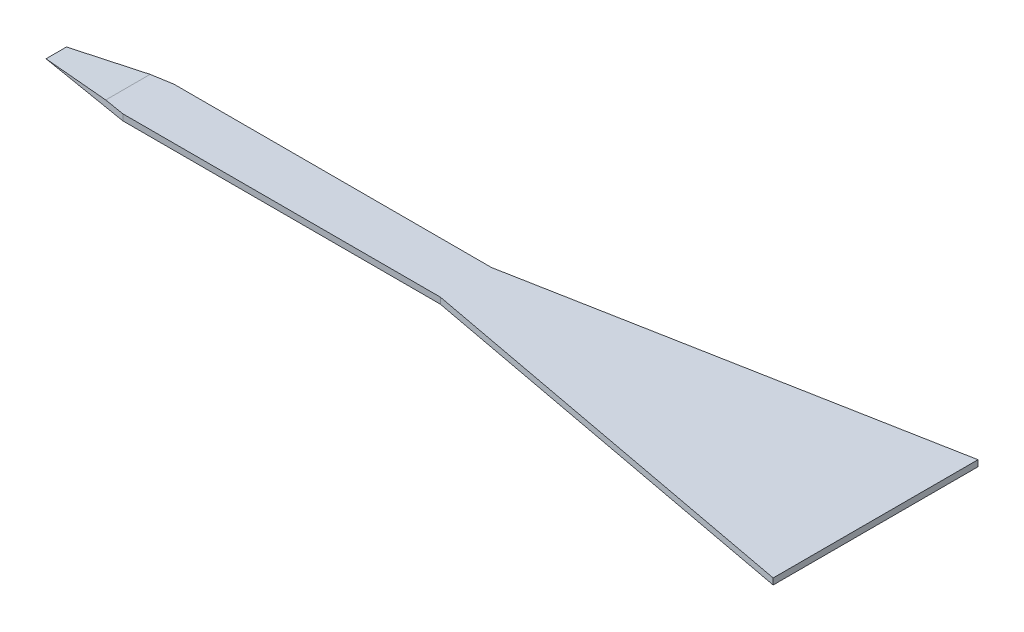
ISO-10303-21;
HEADER;
FILE_DESCRIPTION(('STEP AP214'),'2;1');
FILE_NAME('part.step','',(''),(''),'','','');
FILE_SCHEMA(('AUTOMOTIVE_DESIGN { 1 0 10303 214 1 1 1 1 }'));
ENDSEC;
DATA;
#1=APPLICATION_CONTEXT('core data for automotive mechanical design processes');
#2=APPLICATION_PROTOCOL_DEFINITION('international standard','automotive_design',2000,#1);
#3=PRODUCT_CONTEXT('',#1,'mechanical');
#4=PRODUCT('Part','Part','',(#3));
#5=PRODUCT_RELATED_PRODUCT_CATEGORY('part','',(#4));
#6=PRODUCT_DEFINITION_FORMATION('','',#4);
#7=PRODUCT_DEFINITION_CONTEXT('part definition',#1,'design');
#8=PRODUCT_DEFINITION('design','',#6,#7);
#9=PRODUCT_DEFINITION_SHAPE('','',#8);
#10=(LENGTH_UNIT() NAMED_UNIT(*) SI_UNIT(.MILLI.,.METRE.));
#11=(NAMED_UNIT(*) PLANE_ANGLE_UNIT() SI_UNIT($,.RADIAN.));
#12=(NAMED_UNIT(*) SI_UNIT($,.STERADIAN.) SOLID_ANGLE_UNIT());
#13=UNCERTAINTY_MEASURE_WITH_UNIT(LENGTH_MEASURE(1.E-05),#10,'distance_accuracy_value','');
#14=(GEOMETRIC_REPRESENTATION_CONTEXT(3) GLOBAL_UNCERTAINTY_ASSIGNED_CONTEXT((#13)) GLOBAL_UNIT_ASSIGNED_CONTEXT((#10,
#11,#12)) REPRESENTATION_CONTEXT('',''));
#15=CARTESIAN_POINT('',(0.,0.,0.));
#16=DIRECTION('',(0.,0.,1.));
#17=DIRECTION('',(1.,0.,0.));
#18=AXIS2_PLACEMENT_3D('',#15,#16,#17);
#19=CARTESIAN_POINT('',(0.,0.06,-0.25));
#20=DIRECTION('',(0.,0.,-1.));
#21=DIRECTION('',(-1.,0.,0.));
#22=AXIS2_PLACEMENT_3D('',#19,#20,#21);
#23=PLANE('',#22);
#24=DIRECTION('',(1.,0.,0.));
#25=VECTOR('',#24,1.);
#26=CARTESIAN_POINT('',(0.,0.,-0.25));
#27=LINE('',#26,#25);
#28=CARTESIAN_POINT('',(-7.1,0.,-0.249999999999999));
#29=VERTEX_POINT('',#28);
#30=CARTESIAN_POINT('',(-4.,0.,-0.25));
#31=VERTEX_POINT('',#30);
#32=EDGE_CURVE('E125',#29,#31,#27,.T.);
#33=ORIENTED_EDGE('',*,*,#32,.F.);
#34=DIRECTION('',(0.,-1.,0.));
#35=VECTOR('',#34,1.);
#36=CARTESIAN_POINT('',(-7.1,0.06,-0.249999999999999));
#37=LINE('',#36,#35);
#38=CARTESIAN_POINT('',(-7.1,0.06,-0.249999999999999));
#39=VERTEX_POINT('',#38);
#40=EDGE_CURVE('E112',#39,#29,#37,.T.);
#41=ORIENTED_EDGE('',*,*,#40,.F.);
#42=DIRECTION('',(1.,0.,0.));
#43=VECTOR('',#42,1.);
#44=CARTESIAN_POINT('',(0.,0.06,-0.25));
#45=LINE('',#44,#43);
#46=CARTESIAN_POINT('',(-4.,0.06,-0.25));
#47=VERTEX_POINT('',#46);
#48=EDGE_CURVE('E123',#39,#47,#45,.T.);
#49=ORIENTED_EDGE('',*,*,#48,.T.);
#50=DIRECTION('',(0.,-1.,0.));
#51=VECTOR('',#50,1.);
#52=CARTESIAN_POINT('',(-4.,0.06,-0.25));
#53=LINE('',#52,#51);
#54=EDGE_CURVE('E196',#47,#31,#53,.T.);
#55=ORIENTED_EDGE('',*,*,#54,.T.);
#56=EDGE_LOOP('',(#33,#41,#49,#55));
#57=FACE_BOUND('',#56,.T.);
#58=ADVANCED_FACE('F43',(#57),#23,.T.);
#59=CARTESIAN_POINT('',(0.,0.06,0.));
#60=DIRECTION('',(0.,1.,0.));
#61=DIRECTION('',(0.,0.,1.));
#62=AXIS2_PLACEMENT_3D('',#59,#60,#61);
#63=PLANE('',#62);
#64=ORIENTED_EDGE('',*,*,#48,.F.);
#65=DIRECTION('',(0.986393923832144,0.,-0.164398987305357));
#66=VECTOR('',#65,1.);
#67=CARTESIAN_POINT('',(-8.,0.06,-0.0999999999999998));
#68=LINE('',#67,#66);
#69=CARTESIAN_POINT('',(-7.30000000000001,0.0599999999999994,-0.216666666666664));
#70=VERTEX_POINT('',#69);
#71=EDGE_CURVE('E109',#70,#39,#68,.T.);
#72=ORIENTED_EDGE('',*,*,#71,.F.);
#73=DIRECTION('',(0.,0.,1.));
#74=VECTOR('',#73,1.);
#75=CARTESIAN_POINT('',(-7.3,0.06,-1.));
#76=LINE('',#75,#74);
#77=CARTESIAN_POINT('',(-7.3,0.06,0.216666666666666));
#78=VERTEX_POINT('',#77);
#79=EDGE_CURVE('E118',#70,#78,#76,.T.);
#80=ORIENTED_EDGE('',*,*,#79,.T.);
#81=DIRECTION('',(0.986393923832144,0.,0.164398987305357));
#82=VECTOR('',#81,1.);
#83=CARTESIAN_POINT('',(-8.,0.06,0.0999999999999998));
#84=LINE('',#83,#82);
#85=CARTESIAN_POINT('',(-7.1,0.06,0.249999999999999));
#86=VERTEX_POINT('',#85);
#87=EDGE_CURVE('E62',#78,#86,#84,.T.);
#88=ORIENTED_EDGE('',*,*,#87,.T.);
#89=DIRECTION('',(1.,0.,0.));
#90=VECTOR('',#89,1.);
#91=CARTESIAN_POINT('',(0.,0.06,0.25));
#92=LINE('',#91,#90);
#93=CARTESIAN_POINT('',(-4.,0.06,0.25));
#94=VERTEX_POINT('',#93);
#95=EDGE_CURVE('E47',#86,#94,#92,.T.);
#96=ORIENTED_EDGE('',*,*,#95,.T.);
#97=DIRECTION('',(-0.982872186934322,0.,-0.184288535050185));
#98=VECTOR('',#97,1.);
#99=CARTESIAN_POINT('',(-0.181132075471698,0.06,0.966037735849057));
#100=LINE('',#99,#98);
#101=CARTESIAN_POINT('',(0.,0.06,1.));
#102=VERTEX_POINT('',#101);
#103=EDGE_CURVE('E136',#102,#94,#100,.T.);
#104=ORIENTED_EDGE('',*,*,#103,.F.);
#105=DIRECTION('',(0.,0.,1.));
#106=VECTOR('',#105,1.);
#107=CARTESIAN_POINT('',(0.,0.06,0.));
#108=LINE('',#107,#106);
#109=CARTESIAN_POINT('',(0.,0.06,-1.));
#110=VERTEX_POINT('',#109);
#111=EDGE_CURVE('E137',#110,#102,#108,.T.);
#112=ORIENTED_EDGE('',*,*,#111,.F.);
#113=DIRECTION('',(-0.982872186934322,0.,0.184288535050185));
#114=VECTOR('',#113,1.);
#115=CARTESIAN_POINT('',(-0.181132075471698,0.06,-0.966037735849057));
#116=LINE('',#115,#114);
#117=EDGE_CURVE('E131',#110,#47,#116,.T.);
#118=ORIENTED_EDGE('',*,*,#117,.T.);
#119=EDGE_LOOP('',(#64,#72,#80,#88,#96,#104,#112,#118));
#120=FACE_BOUND('',#119,.T.);
#121=ADVANCED_FACE('F128',(#120),#63,.T.);
#122=CARTESIAN_POINT('',(0.,0.,0.));
#123=DIRECTION('',(0.,1.,0.));
#124=DIRECTION('',(0.,0.,1.));
#125=AXIS2_PLACEMENT_3D('',#122,#123,#124);
#126=PLANE('',#125);
#127=DIRECTION('',(0.986393923832144,0.,-0.164398987305357));
#128=VECTOR('',#127,1.);
#129=CARTESIAN_POINT('',(-8.,0.,-0.0999999999999998));
#130=LINE('',#129,#128);
#131=CARTESIAN_POINT('',(-8.,0.,-0.0999999999999998));
#132=VERTEX_POINT('',#131);
#133=EDGE_CURVE('E70',#132,#29,#130,.T.);
#134=ORIENTED_EDGE('',*,*,#133,.T.);
#135=ORIENTED_EDGE('',*,*,#32,.T.);
#136=DIRECTION('',(-0.982872186934322,0.,0.184288535050185));
#137=VECTOR('',#136,1.);
#138=CARTESIAN_POINT('',(-0.181132075471698,0.,-0.966037735849057));
#139=LINE('',#138,#137);
#140=CARTESIAN_POINT('',(0.,0.,-1.));
#141=VERTEX_POINT('',#140);
#142=EDGE_CURVE('E155',#141,#31,#139,.T.);
#143=ORIENTED_EDGE('',*,*,#142,.F.);
#144=DIRECTION('',(0.,0.,1.));
#145=VECTOR('',#144,1.);
#146=CARTESIAN_POINT('',(0.,0.,0.));
#147=LINE('',#146,#145);
#148=CARTESIAN_POINT('',(0.,0.,1.));
#149=VERTEX_POINT('',#148);
#150=EDGE_CURVE('E151',#141,#149,#147,.T.);
#151=ORIENTED_EDGE('',*,*,#150,.T.);
#152=DIRECTION('',(-0.982872186934322,0.,-0.184288535050185));
#153=VECTOR('',#152,1.);
#154=CARTESIAN_POINT('',(-0.181132075471698,0.,0.966037735849057));
#155=LINE('',#154,#153);
#156=CARTESIAN_POINT('',(-4.,0.,0.25));
#157=VERTEX_POINT('',#156);
#158=EDGE_CURVE('E179',#149,#157,#155,.T.);
#159=ORIENTED_EDGE('',*,*,#158,.T.);
#160=DIRECTION('',(1.,0.,0.));
#161=VECTOR('',#160,1.);
#162=CARTESIAN_POINT('',(0.,0.,0.25));
#163=LINE('',#162,#161);
#164=CARTESIAN_POINT('',(-7.1,0.,0.249999999999999));
#165=VERTEX_POINT('',#164);
#166=EDGE_CURVE('E170',#165,#157,#163,.T.);
#167=ORIENTED_EDGE('',*,*,#166,.F.);
#168=DIRECTION('',(0.986393923832144,0.,0.164398987305357));
#169=VECTOR('',#168,1.);
#170=CARTESIAN_POINT('',(-8.,0.,0.0999999999999998));
#171=LINE('',#170,#169);
#172=CARTESIAN_POINT('',(-8.,0.,0.0999999999999998));
#173=VERTEX_POINT('',#172);
#174=EDGE_CURVE('E212',#173,#165,#171,.T.);
#175=ORIENTED_EDGE('',*,*,#174,.F.);
#176=DIRECTION('',(0.,0.,-1.));
#177=VECTOR('',#176,1.);
#178=CARTESIAN_POINT('',(-8.,0.,0.));
#179=LINE('',#178,#177);
#180=EDGE_CURVE('E165',#173,#132,#179,.T.);
#181=ORIENTED_EDGE('',*,*,#180,.T.);
#182=EDGE_LOOP('',(#134,#135,#143,#151,#159,#167,#175,#181));
#183=FACE_BOUND('',#182,.T.);
#184=ADVANCED_FACE('F204',(#183),#126,.F.);
#185=CARTESIAN_POINT('',(-7.3,0.06,-1.));
#186=DIRECTION('',(-0.0854011413464358,0.996346649041751,0.));
#187=DIRECTION('',(-0.996346649041751,-0.0854011413464358,0.));
#188=AXIS2_PLACEMENT_3D('',#185,#186,#187);
#189=PLANE('',#188);
#190=ORIENTED_EDGE('',*,*,#79,.F.);
#191=DIRECTION('',(-0.982887157648091,-0.0842474706555507,0.163814526274681));
#192=VECTOR('',#191,1.);
#193=CARTESIAN_POINT('',(-7.17387456461259,0.0708107516046353,-0.237687572564568));
#194=LINE('',#193,#192);
#195=EDGE_CURVE('E12',#70,#132,#194,.T.);
#196=ORIENTED_EDGE('',*,*,#195,.T.);
#197=ORIENTED_EDGE('',*,*,#180,.F.);
#198=DIRECTION('',(-0.982887157648091,-0.0842474706555507,-0.163814526274681));
#199=VECTOR('',#198,1.);
#200=CARTESIAN_POINT('',(-7.49589695283577,0.043208832614077,0.184017174527372));
#201=LINE('',#200,#199);
#202=EDGE_CURVE('E54',#78,#173,#201,.T.);
#203=ORIENTED_EDGE('',*,*,#202,.F.);
#204=EDGE_LOOP('',(#190,#196,#197,#203));
#205=FACE_BOUND('',#204,.T.);
#206=ADVANCED_FACE('F236',(#205),#189,.T.);
#207=CARTESIAN_POINT('',(0.,0.06,0.25));
#208=DIRECTION('',(0.,0.,-1.));
#209=DIRECTION('',(-1.,0.,0.));
#210=AXIS2_PLACEMENT_3D('',#207,#208,#209);
#211=PLANE('',#210);
#212=ORIENTED_EDGE('',*,*,#95,.F.);
#213=DIRECTION('',(0.,-1.,0.));
#214=VECTOR('',#213,1.);
#215=CARTESIAN_POINT('',(-7.1,0.06,0.249999999999999));
#216=LINE('',#215,#214);
#217=EDGE_CURVE('E210',#86,#165,#216,.T.);
#218=ORIENTED_EDGE('',*,*,#217,.T.);
#219=ORIENTED_EDGE('',*,*,#166,.T.);
#220=DIRECTION('',(0.,-1.,0.));
#221=VECTOR('',#220,1.);
#222=CARTESIAN_POINT('',(-4.,0.06,0.25));
#223=LINE('',#222,#221);
#224=EDGE_CURVE('E194',#94,#157,#223,.T.);
#225=ORIENTED_EDGE('',*,*,#224,.F.);
#226=EDGE_LOOP('',(#212,#218,#219,#225));
#227=FACE_BOUND('',#226,.T.);
#228=ADVANCED_FACE('F209',(#227),#211,.F.);
#229=CARTESIAN_POINT('',(0.,0.06,0.));
#230=DIRECTION('',(1.,0.,0.));
#231=DIRECTION('',(0.,0.,-1.));
#232=AXIS2_PLACEMENT_3D('',#229,#230,#231);
#233=PLANE('',#232);
#234=ORIENTED_EDGE('',*,*,#150,.F.);
#235=DIRECTION('',(0.,-1.,0.));
#236=VECTOR('',#235,1.);
#237=CARTESIAN_POINT('',(0.,0.06,-1.));
#238=LINE('',#237,#236);
#239=EDGE_CURVE('E171',#110,#141,#238,.T.);
#240=ORIENTED_EDGE('',*,*,#239,.F.);
#241=ORIENTED_EDGE('',*,*,#111,.T.);
#242=DIRECTION('',(0.,-1.,0.));
#243=VECTOR('',#242,1.);
#244=CARTESIAN_POINT('',(0.,0.06,1.));
#245=LINE('',#244,#243);
#246=EDGE_CURVE('E150',#102,#149,#245,.T.);
#247=ORIENTED_EDGE('',*,*,#246,.T.);
#248=EDGE_LOOP('',(#234,#240,#241,#247));
#249=FACE_BOUND('',#248,.T.);
#250=ADVANCED_FACE('F45',(#249),#233,.T.);
#251=CARTESIAN_POINT('',(-0.181132075471698,0.06,-0.966037735849057));
#252=DIRECTION('',(0.184288535050185,0.,0.982872186934322));
#253=DIRECTION('',(0.982872186934322,0.,-0.184288535050185));
#254=AXIS2_PLACEMENT_3D('',#251,#252,#253);
#255=PLANE('',#254);
#256=ORIENTED_EDGE('',*,*,#142,.T.);
#257=ORIENTED_EDGE('',*,*,#54,.F.);
#258=ORIENTED_EDGE('',*,*,#117,.F.);
#259=ORIENTED_EDGE('',*,*,#239,.T.);
#260=EDGE_LOOP('',(#256,#257,#258,#259));
#261=FACE_BOUND('',#260,.T.);
#262=ADVANCED_FACE('F201',(#261),#255,.F.);
#263=CARTESIAN_POINT('',(-0.181132075471698,0.06,0.966037735849057));
#264=DIRECTION('',(-0.184288535050185,0.,0.982872186934322));
#265=DIRECTION('',(0.982872186934322,0.,0.184288535050185));
#266=AXIS2_PLACEMENT_3D('',#263,#264,#265);
#267=PLANE('',#266);
#268=ORIENTED_EDGE('',*,*,#158,.F.);
#269=ORIENTED_EDGE('',*,*,#246,.F.);
#270=ORIENTED_EDGE('',*,*,#103,.T.);
#271=ORIENTED_EDGE('',*,*,#224,.T.);
#272=EDGE_LOOP('',(#268,#269,#270,#271));
#273=FACE_BOUND('',#272,.T.);
#274=ADVANCED_FACE('F207',(#273),#267,.T.);
#275=CARTESIAN_POINT('',(-8.,0.06,0.0999999999999998));
#276=DIRECTION('',(0.164398987305357,0.,-0.986393923832144));
#277=DIRECTION('',(-0.986393923832144,0.,-0.164398987305357));
#278=AXIS2_PLACEMENT_3D('',#275,#276,#277);
#279=PLANE('',#278);
#280=ORIENTED_EDGE('',*,*,#202,.T.);
#281=ORIENTED_EDGE('',*,*,#174,.T.);
#282=ORIENTED_EDGE('',*,*,#217,.F.);
#283=ORIENTED_EDGE('',*,*,#87,.F.);
#284=EDGE_LOOP('',(#280,#281,#282,#283));
#285=FACE_BOUND('',#284,.T.);
#286=ADVANCED_FACE('F239',(#285),#279,.F.);
#287=CARTESIAN_POINT('',(-8.,0.06,-0.0999999999999998));
#288=DIRECTION('',(-0.164398987305357,0.,-0.986393923832144));
#289=DIRECTION('',(-0.986393923832144,0.,0.164398987305357));
#290=AXIS2_PLACEMENT_3D('',#287,#288,#289);
#291=PLANE('',#290);
#292=ORIENTED_EDGE('',*,*,#71,.T.);
#293=ORIENTED_EDGE('',*,*,#40,.T.);
#294=ORIENTED_EDGE('',*,*,#133,.F.);
#295=ORIENTED_EDGE('',*,*,#195,.F.);
#296=EDGE_LOOP('',(#292,#293,#294,#295));
#297=FACE_BOUND('',#296,.T.);
#298=ADVANCED_FACE('F111',(#297),#291,.T.);
#299=CLOSED_SHELL('',(#58,#121,#184,#206,#228,#250,#262,#274,#286,#298));
#300=MANIFOLD_SOLID_BREP('B2',#299);
#301=ADVANCED_BREP_SHAPE_REPRESENTATION('',(#18,#300),#14);
#302=SHAPE_DEFINITION_REPRESENTATION(#9,#301);
ENDSEC;
END-ISO-10303-21;
